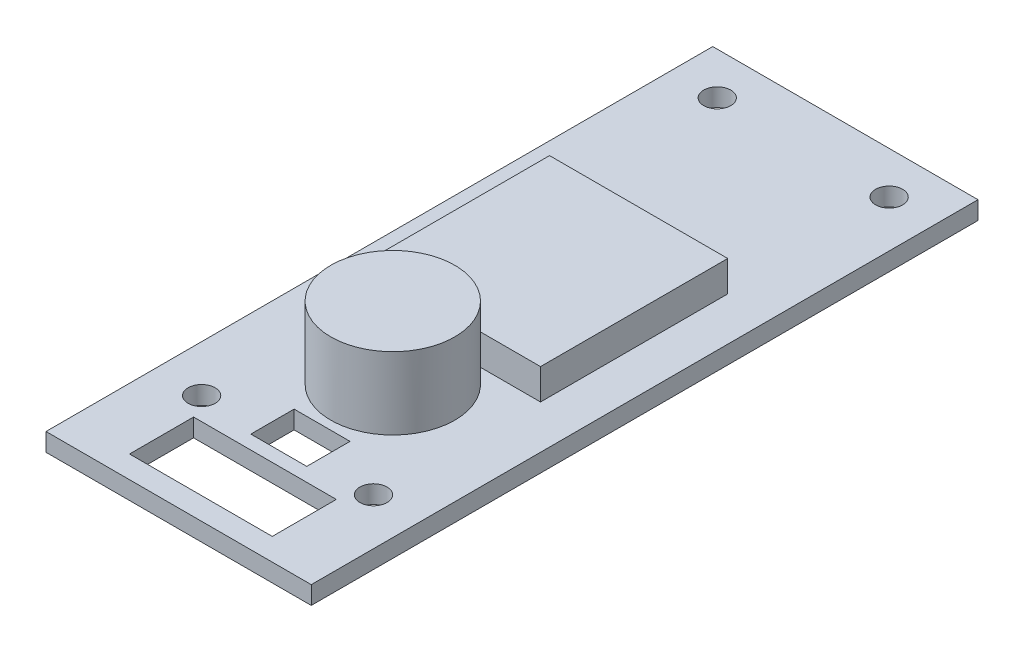
ISO-10303-21;
HEADER;
FILE_DESCRIPTION(('STEP AP214'),'2;1');
FILE_NAME('part.step','',(''),(''),'','','');
FILE_SCHEMA(('AUTOMOTIVE_DESIGN { 1 0 10303 214 1 1 1 1 }'));
ENDSEC;
DATA;
#1=APPLICATION_CONTEXT('core data for automotive mechanical design processes');
#2=APPLICATION_PROTOCOL_DEFINITION('international standard','automotive_design',2000,#1);
#3=PRODUCT_CONTEXT('',#1,'mechanical');
#4=PRODUCT('Part','Part','',(#3));
#5=PRODUCT_RELATED_PRODUCT_CATEGORY('part','',(#4));
#6=PRODUCT_DEFINITION_FORMATION('','',#4);
#7=PRODUCT_DEFINITION_CONTEXT('part definition',#1,'design');
#8=PRODUCT_DEFINITION('design','',#6,#7);
#9=PRODUCT_DEFINITION_SHAPE('','',#8);
#10=(LENGTH_UNIT() NAMED_UNIT(*) SI_UNIT(.MILLI.,.METRE.));
#11=(NAMED_UNIT(*) PLANE_ANGLE_UNIT() SI_UNIT($,.RADIAN.));
#12=(NAMED_UNIT(*) SI_UNIT($,.STERADIAN.) SOLID_ANGLE_UNIT());
#13=UNCERTAINTY_MEASURE_WITH_UNIT(LENGTH_MEASURE(1.E-05),#10,'distance_accuracy_value','');
#14=(GEOMETRIC_REPRESENTATION_CONTEXT(3) GLOBAL_UNCERTAINTY_ASSIGNED_CONTEXT((#13)) GLOBAL_UNIT_ASSIGNED_CONTEXT((#10,
#11,#12)) REPRESENTATION_CONTEXT('',''));
#15=CARTESIAN_POINT('',(0.,0.,0.));
#16=DIRECTION('',(0.,0.,1.));
#17=DIRECTION('',(1.,0.,0.));
#18=AXIS2_PLACEMENT_3D('',#15,#16,#17);
#19=CARTESIAN_POINT('',(0.,2.,36.95));
#20=DIRECTION('',(0.,0.,1.));
#21=DIRECTION('',(1.,0.,0.));
#22=AXIS2_PLACEMENT_3D('',#19,#20,#21);
#23=PLANE('',#22);
#24=DIRECTION('',(-1.,0.,0.));
#25=VECTOR('',#24,1.);
#26=CARTESIAN_POINT('',(0.,0.,36.95));
#27=LINE('',#26,#25);
#28=CARTESIAN_POINT('',(14.7,0.,36.95));
#29=VERTEX_POINT('',#28);
#30=CARTESIAN_POINT('',(-14.7,0.,36.95));
#31=VERTEX_POINT('',#30);
#32=EDGE_CURVE('E253',#29,#31,#27,.T.);
#33=ORIENTED_EDGE('',*,*,#32,.F.);
#34=DIRECTION('',(0.,-1.,0.));
#35=VECTOR('',#34,1.);
#36=CARTESIAN_POINT('',(14.7,2.,36.95));
#37=LINE('',#36,#35);
#38=CARTESIAN_POINT('',(14.7,2.,36.95));
#39=VERTEX_POINT('',#38);
#40=EDGE_CURVE('E12',#39,#29,#37,.T.);
#41=ORIENTED_EDGE('',*,*,#40,.F.);
#42=DIRECTION('',(-1.,0.,0.));
#43=VECTOR('',#42,1.);
#44=CARTESIAN_POINT('',(0.,2.,36.95));
#45=LINE('',#44,#43);
#46=CARTESIAN_POINT('',(-14.7,2.,36.95));
#47=VERTEX_POINT('',#46);
#48=EDGE_CURVE('E183',#39,#47,#45,.T.);
#49=ORIENTED_EDGE('',*,*,#48,.T.);
#50=DIRECTION('',(0.,-1.,0.));
#51=VECTOR('',#50,1.);
#52=CARTESIAN_POINT('',(-14.7,2.,36.95));
#53=LINE('',#52,#51);
#54=EDGE_CURVE('E70',#47,#31,#53,.T.);
#55=ORIENTED_EDGE('',*,*,#54,.T.);
#56=EDGE_LOOP('',(#33,#41,#49,#55));
#57=FACE_BOUND('',#56,.T.);
#58=ADVANCED_FACE('F44',(#57),#23,.T.);
#59=CARTESIAN_POINT('',(14.7,2.,0.));
#60=DIRECTION('',(-1.,0.,0.));
#61=DIRECTION('',(0.,0.,1.));
#62=AXIS2_PLACEMENT_3D('',#59,#60,#61);
#63=PLANE('',#62);
#64=DIRECTION('',(0.,0.,-1.));
#65=VECTOR('',#64,1.);
#66=CARTESIAN_POINT('',(14.7,0.,0.));
#67=LINE('',#66,#65);
#68=CARTESIAN_POINT('',(14.7,0.,-36.95));
#69=VERTEX_POINT('',#68);
#70=EDGE_CURVE('E188',#29,#69,#67,.T.);
#71=ORIENTED_EDGE('',*,*,#70,.T.);
#72=DIRECTION('',(0.,-1.,0.));
#73=VECTOR('',#72,1.);
#74=CARTESIAN_POINT('',(14.7,2.,-36.95));
#75=LINE('',#74,#73);
#76=CARTESIAN_POINT('',(14.7,2.,-36.95));
#77=VERTEX_POINT('',#76);
#78=EDGE_CURVE('E53',#77,#69,#75,.T.);
#79=ORIENTED_EDGE('',*,*,#78,.F.);
#80=DIRECTION('',(0.,0.,-1.));
#81=VECTOR('',#80,1.);
#82=CARTESIAN_POINT('',(14.7,2.,0.));
#83=LINE('',#82,#81);
#84=EDGE_CURVE('E178',#39,#77,#83,.T.);
#85=ORIENTED_EDGE('',*,*,#84,.F.);
#86=ORIENTED_EDGE('',*,*,#40,.T.);
#87=EDGE_LOOP('',(#71,#79,#85,#86));
#88=FACE_BOUND('',#87,.T.);
#89=ADVANCED_FACE('F186',(#88),#63,.F.);
#90=CARTESIAN_POINT('',(0.,2.,-36.95));
#91=DIRECTION('',(0.,0.,1.));
#92=DIRECTION('',(1.,0.,0.));
#93=AXIS2_PLACEMENT_3D('',#90,#91,#92);
#94=PLANE('',#93);
#95=DIRECTION('',(-1.,0.,0.));
#96=VECTOR('',#95,1.);
#97=CARTESIAN_POINT('',(0.,0.,-36.95));
#98=LINE('',#97,#96);
#99=CARTESIAN_POINT('',(-14.7,0.,-36.95));
#100=VERTEX_POINT('',#99);
#101=EDGE_CURVE('E256',#69,#100,#98,.T.);
#102=ORIENTED_EDGE('',*,*,#101,.T.);
#103=DIRECTION('',(0.,-1.,0.));
#104=VECTOR('',#103,1.);
#105=CARTESIAN_POINT('',(-14.7,2.,-36.95));
#106=LINE('',#105,#104);
#107=CARTESIAN_POINT('',(-14.7,2.,-36.95));
#108=VERTEX_POINT('',#107);
#109=EDGE_CURVE('E174',#108,#100,#106,.T.);
#110=ORIENTED_EDGE('',*,*,#109,.F.);
#111=DIRECTION('',(-1.,0.,0.));
#112=VECTOR('',#111,1.);
#113=CARTESIAN_POINT('',(0.,2.,-36.95));
#114=LINE('',#113,#112);
#115=EDGE_CURVE('E168',#77,#108,#114,.T.);
#116=ORIENTED_EDGE('',*,*,#115,.F.);
#117=ORIENTED_EDGE('',*,*,#78,.T.);
#118=EDGE_LOOP('',(#102,#110,#116,#117));
#119=FACE_BOUND('',#118,.T.);
#120=ADVANCED_FACE('F171',(#119),#94,.F.);
#121=CARTESIAN_POINT('',(-7.91000000000001,2.,0.));
#122=DIRECTION('',(1.,0.,0.));
#123=DIRECTION('',(0.,0.,-1.));
#124=AXIS2_PLACEMENT_3D('',#121,#122,#123);
#125=PLANE('',#124);
#126=DIRECTION('',(0.,0.,1.));
#127=VECTOR('',#126,1.);
#128=CARTESIAN_POINT('',(-7.91000000000001,0.,0.));
#129=LINE('',#128,#127);
#130=CARTESIAN_POINT('',(-7.91,0.,27.382));
#131=VERTEX_POINT('',#130);
#132=CARTESIAN_POINT('',(-7.91,0.,34.482));
#133=VERTEX_POINT('',#132);
#134=EDGE_CURVE('E241',#131,#133,#129,.T.);
#135=ORIENTED_EDGE('',*,*,#134,.F.);
#136=DIRECTION('',(0.,-1.,0.));
#137=VECTOR('',#136,1.);
#138=CARTESIAN_POINT('',(-7.91,2.,27.382));
#139=LINE('',#138,#137);
#140=CARTESIAN_POINT('',(-7.91,2.,27.382));
#141=VERTEX_POINT('',#140);
#142=EDGE_CURVE('E200',#141,#131,#139,.T.);
#143=ORIENTED_EDGE('',*,*,#142,.F.);
#144=DIRECTION('',(0.,0.,1.));
#145=VECTOR('',#144,1.);
#146=CARTESIAN_POINT('',(-7.91000000000001,2.,0.));
#147=LINE('',#146,#145);
#148=CARTESIAN_POINT('',(-7.91,2.,34.482));
#149=VERTEX_POINT('',#148);
#150=EDGE_CURVE('E286',#141,#149,#147,.T.);
#151=ORIENTED_EDGE('',*,*,#150,.T.);
#152=DIRECTION('',(0.,-1.,0.));
#153=VECTOR('',#152,1.);
#154=CARTESIAN_POINT('',(-7.91,2.,34.482));
#155=LINE('',#154,#153);
#156=EDGE_CURVE('E193',#149,#133,#155,.T.);
#157=ORIENTED_EDGE('',*,*,#156,.T.);
#158=EDGE_LOOP('',(#135,#143,#151,#157));
#159=FACE_BOUND('',#158,.T.);
#160=ADVANCED_FACE('F418',(#159),#125,.T.);
#161=CARTESIAN_POINT('',(0.,2.,27.382));
#162=DIRECTION('',(0.,0.,-1.));
#163=DIRECTION('',(-1.,0.,0.));
#164=AXIS2_PLACEMENT_3D('',#161,#162,#163);
#165=PLANE('',#164);
#166=DIRECTION('',(1.,0.,0.));
#167=VECTOR('',#166,1.);
#168=CARTESIAN_POINT('',(0.,0.,27.382));
#169=LINE('',#168,#167);
#170=CARTESIAN_POINT('',(7.91,0.,27.382));
#171=VERTEX_POINT('',#170);
#172=EDGE_CURVE('E244',#131,#171,#169,.T.);
#173=ORIENTED_EDGE('',*,*,#172,.T.);
#174=DIRECTION('',(0.,-1.,0.));
#175=VECTOR('',#174,1.);
#176=CARTESIAN_POINT('',(7.91,2.,27.382));
#177=LINE('',#176,#175);
#178=CARTESIAN_POINT('',(7.91,2.,27.382));
#179=VERTEX_POINT('',#178);
#180=EDGE_CURVE('E197',#179,#171,#177,.T.);
#181=ORIENTED_EDGE('',*,*,#180,.F.);
#182=DIRECTION('',(1.,0.,0.));
#183=VECTOR('',#182,1.);
#184=CARTESIAN_POINT('',(0.,2.,27.382));
#185=LINE('',#184,#183);
#186=EDGE_CURVE('E289',#141,#179,#185,.T.);
#187=ORIENTED_EDGE('',*,*,#186,.F.);
#188=ORIENTED_EDGE('',*,*,#142,.T.);
#189=EDGE_LOOP('',(#173,#181,#187,#188));
#190=FACE_BOUND('',#189,.T.);
#191=ADVANCED_FACE('F414',(#190),#165,.F.);
#192=CARTESIAN_POINT('',(7.90999999999999,2.,0.));
#193=DIRECTION('',(1.,0.,0.));
#194=DIRECTION('',(0.,0.,-1.));
#195=AXIS2_PLACEMENT_3D('',#192,#193,#194);
#196=PLANE('',#195);
#197=DIRECTION('',(0.,0.,1.));
#198=VECTOR('',#197,1.);
#199=CARTESIAN_POINT('',(7.90999999999999,0.,0.));
#200=LINE('',#199,#198);
#201=CARTESIAN_POINT('',(7.91,0.,34.482));
#202=VERTEX_POINT('',#201);
#203=EDGE_CURVE('E247',#171,#202,#200,.T.);
#204=ORIENTED_EDGE('',*,*,#203,.T.);
#205=DIRECTION('',(0.,-1.,0.));
#206=VECTOR('',#205,1.);
#207=CARTESIAN_POINT('',(7.91,2.,34.482));
#208=LINE('',#207,#206);
#209=CARTESIAN_POINT('',(7.91,2.,34.482));
#210=VERTEX_POINT('',#209);
#211=EDGE_CURVE('E195',#210,#202,#208,.T.);
#212=ORIENTED_EDGE('',*,*,#211,.F.);
#213=DIRECTION('',(0.,0.,1.));
#214=VECTOR('',#213,1.);
#215=CARTESIAN_POINT('',(7.90999999999999,2.,0.));
#216=LINE('',#215,#214);
#217=EDGE_CURVE('E292',#179,#210,#216,.T.);
#218=ORIENTED_EDGE('',*,*,#217,.F.);
#219=ORIENTED_EDGE('',*,*,#180,.T.);
#220=EDGE_LOOP('',(#204,#212,#218,#219));
#221=FACE_BOUND('',#220,.T.);
#222=ADVANCED_FACE('F411',(#221),#196,.F.);
#223=CARTESIAN_POINT('',(3.1,2.,0.));
#224=DIRECTION('',(-1.,0.,0.));
#225=DIRECTION('',(0.,0.,1.));
#226=AXIS2_PLACEMENT_3D('',#223,#224,#225);
#227=PLANE('',#226);
#228=DIRECTION('',(0.,0.,-1.));
#229=VECTOR('',#228,1.);
#230=CARTESIAN_POINT('',(3.1,0.,0.));
#231=LINE('',#230,#229);
#232=CARTESIAN_POINT('',(3.1,0.,25.849));
#233=VERTEX_POINT('',#232);
#234=CARTESIAN_POINT('',(3.1,0.,21.049));
#235=VERTEX_POINT('',#234);
#236=EDGE_CURVE('E227',#233,#235,#231,.T.);
#237=ORIENTED_EDGE('',*,*,#236,.F.);
#238=DIRECTION('',(0.,-1.,0.));
#239=VECTOR('',#238,1.);
#240=CARTESIAN_POINT('',(3.1,2.,25.849));
#241=LINE('',#240,#239);
#242=CARTESIAN_POINT('',(3.1,2.,25.849));
#243=VERTEX_POINT('',#242);
#244=EDGE_CURVE('E48',#243,#233,#241,.T.);
#245=ORIENTED_EDGE('',*,*,#244,.F.);
#246=DIRECTION('',(0.,0.,-1.));
#247=VECTOR('',#246,1.);
#248=CARTESIAN_POINT('',(3.1,2.,0.));
#249=LINE('',#248,#247);
#250=CARTESIAN_POINT('',(3.1,2.,21.049));
#251=VERTEX_POINT('',#250);
#252=EDGE_CURVE('E278',#243,#251,#249,.T.);
#253=ORIENTED_EDGE('',*,*,#252,.T.);
#254=DIRECTION('',(0.,-1.,0.));
#255=VECTOR('',#254,1.);
#256=CARTESIAN_POINT('',(3.1,2.,21.049));
#257=LINE('',#256,#255);
#258=EDGE_CURVE('E202',#251,#235,#257,.T.);
#259=ORIENTED_EDGE('',*,*,#258,.T.);
#260=EDGE_LOOP('',(#237,#245,#253,#259));
#261=FACE_BOUND('',#260,.T.);
#262=ADVANCED_FACE('F46',(#261),#227,.T.);
#263=CARTESIAN_POINT('',(0.,2.,25.849));
#264=DIRECTION('',(0.,0.,1.));
#265=DIRECTION('',(1.,0.,0.));
#266=AXIS2_PLACEMENT_3D('',#263,#264,#265);
#267=PLANE('',#266);
#268=DIRECTION('',(-1.,0.,0.));
#269=VECTOR('',#268,1.);
#270=CARTESIAN_POINT('',(0.,0.,25.849));
#271=LINE('',#270,#269);
#272=CARTESIAN_POINT('',(-3.1,0.,25.849));
#273=VERTEX_POINT('',#272);
#274=EDGE_CURVE('E215',#233,#273,#271,.T.);
#275=ORIENTED_EDGE('',*,*,#274,.T.);
#276=DIRECTION('',(0.,-1.,0.));
#277=VECTOR('',#276,1.);
#278=CARTESIAN_POINT('',(-3.1,2.,25.849));
#279=LINE('',#278,#277);
#280=CARTESIAN_POINT('',(-3.1,2.,25.849));
#281=VERTEX_POINT('',#280);
#282=EDGE_CURVE('E205',#281,#273,#279,.T.);
#283=ORIENTED_EDGE('',*,*,#282,.F.);
#284=DIRECTION('',(-1.,0.,0.));
#285=VECTOR('',#284,1.);
#286=CARTESIAN_POINT('',(0.,2.,25.849));
#287=LINE('',#286,#285);
#288=EDGE_CURVE('E217',#243,#281,#287,.T.);
#289=ORIENTED_EDGE('',*,*,#288,.F.);
#290=ORIENTED_EDGE('',*,*,#244,.T.);
#291=EDGE_LOOP('',(#275,#283,#289,#290));
#292=FACE_BOUND('',#291,.T.);
#293=ADVANCED_FACE('F214',(#292),#267,.F.);
#294=CARTESIAN_POINT('',(-3.1,2.,0.));
#295=DIRECTION('',(-1.,0.,0.));
#296=DIRECTION('',(0.,0.,1.));
#297=AXIS2_PLACEMENT_3D('',#294,#295,#296);
#298=PLANE('',#297);
#299=DIRECTION('',(0.,0.,-1.));
#300=VECTOR('',#299,1.);
#301=CARTESIAN_POINT('',(-3.1,0.,0.));
#302=LINE('',#301,#300);
#303=CARTESIAN_POINT('',(-3.1,0.,21.049));
#304=VERTEX_POINT('',#303);
#305=EDGE_CURVE('E229',#273,#304,#302,.T.);
#306=ORIENTED_EDGE('',*,*,#305,.T.);
#307=DIRECTION('',(0.,-1.,0.));
#308=VECTOR('',#307,1.);
#309=CARTESIAN_POINT('',(-3.1,2.,21.049));
#310=LINE('',#309,#308);
#311=CARTESIAN_POINT('',(-3.1,2.,21.049));
#312=VERTEX_POINT('',#311);
#313=EDGE_CURVE('E204',#312,#304,#310,.T.);
#314=ORIENTED_EDGE('',*,*,#313,.F.);
#315=DIRECTION('',(0.,0.,-1.));
#316=VECTOR('',#315,1.);
#317=CARTESIAN_POINT('',(-3.1,2.,0.));
#318=LINE('',#317,#316);
#319=EDGE_CURVE('E281',#281,#312,#318,.T.);
#320=ORIENTED_EDGE('',*,*,#319,.F.);
#321=ORIENTED_EDGE('',*,*,#282,.T.);
#322=EDGE_LOOP('',(#306,#314,#320,#321));
#323=FACE_BOUND('',#322,.T.);
#324=ADVANCED_FACE('F409',(#323),#298,.F.);
#325=CARTESIAN_POINT('',(0.,2.,34.482));
#326=DIRECTION('',(0.,0.,-1.));
#327=DIRECTION('',(-1.,0.,0.));
#328=AXIS2_PLACEMENT_3D('',#325,#326,#327);
#329=PLANE('',#328);
#330=DIRECTION('',(1.,0.,0.));
#331=VECTOR('',#330,1.);
#332=CARTESIAN_POINT('',(0.,0.,34.482));
#333=LINE('',#332,#331);
#334=EDGE_CURVE('E250',#133,#202,#333,.T.);
#335=ORIENTED_EDGE('',*,*,#334,.F.);
#336=ORIENTED_EDGE('',*,*,#156,.F.);
#337=DIRECTION('',(1.,0.,0.));
#338=VECTOR('',#337,1.);
#339=CARTESIAN_POINT('',(0.,2.,34.482));
#340=LINE('',#339,#338);
#341=EDGE_CURVE('E294',#149,#210,#340,.T.);
#342=ORIENTED_EDGE('',*,*,#341,.T.);
#343=ORIENTED_EDGE('',*,*,#211,.T.);
#344=EDGE_LOOP('',(#335,#336,#342,#343));
#345=FACE_BOUND('',#344,.T.);
#346=ADVANCED_FACE('F405',(#345),#329,.T.);
#347=CARTESIAN_POINT('',(0.,2.,21.049));
#348=DIRECTION('',(0.,0.,1.));
#349=DIRECTION('',(1.,0.,0.));
#350=AXIS2_PLACEMENT_3D('',#347,#348,#349);
#351=PLANE('',#350);
#352=DIRECTION('',(-1.,0.,0.));
#353=VECTOR('',#352,1.);
#354=CARTESIAN_POINT('',(0.,0.,21.049));
#355=LINE('',#354,#353);
#356=EDGE_CURVE('E239',#235,#304,#355,.T.);
#357=ORIENTED_EDGE('',*,*,#356,.F.);
#358=ORIENTED_EDGE('',*,*,#258,.F.);
#359=DIRECTION('',(-1.,0.,0.));
#360=VECTOR('',#359,1.);
#361=CARTESIAN_POINT('',(0.,2.,21.049));
#362=LINE('',#361,#360);
#363=EDGE_CURVE('E283',#251,#312,#362,.T.);
#364=ORIENTED_EDGE('',*,*,#363,.T.);
#365=ORIENTED_EDGE('',*,*,#313,.T.);
#366=EDGE_LOOP('',(#357,#358,#364,#365));
#367=FACE_BOUND('',#366,.T.);
#368=ADVANCED_FACE('F408',(#367),#351,.T.);
#369=CARTESIAN_POINT('',(-14.7,2.,0.));
#370=DIRECTION('',(-1.,0.,0.));
#371=DIRECTION('',(0.,0.,1.));
#372=AXIS2_PLACEMENT_3D('',#369,#370,#371);
#373=PLANE('',#372);
#374=DIRECTION('',(0.,0.,-1.));
#375=VECTOR('',#374,1.);
#376=CARTESIAN_POINT('',(-14.7,0.,0.));
#377=LINE('',#376,#375);
#378=EDGE_CURVE('E258',#31,#100,#377,.T.);
#379=ORIENTED_EDGE('',*,*,#378,.F.);
#380=ORIENTED_EDGE('',*,*,#54,.F.);
#381=DIRECTION('',(0.,0.,-1.));
#382=VECTOR('',#381,1.);
#383=CARTESIAN_POINT('',(-14.7,2.,0.));
#384=LINE('',#383,#382);
#385=EDGE_CURVE('E177',#47,#108,#384,.T.);
#386=ORIENTED_EDGE('',*,*,#385,.T.);
#387=ORIENTED_EDGE('',*,*,#109,.T.);
#388=EDGE_LOOP('',(#379,#380,#386,#387));
#389=FACE_BOUND('',#388,.T.);
#390=ADVANCED_FACE('F297',(#389),#373,.T.);
#391=CARTESIAN_POINT('',(0.,2.,0.));
#392=DIRECTION('',(0.,1.,0.));
#393=DIRECTION('',(0.,0.,1.));
#394=AXIS2_PLACEMENT_3D('',#391,#392,#393);
#395=PLANE('',#394);
#396=CARTESIAN_POINT('',(-9.525,2.,24.875));
#397=DIRECTION('',(0.,1.,0.));
#398=DIRECTION('',(0.,0.,1.));
#399=AXIS2_PLACEMENT_3D('',#396,#397,#398);
#400=CIRCLE('',#399,1.5);
#401=CARTESIAN_POINT('',(-9.525,2.,26.375));
#402=VERTEX_POINT('',#401);
#403=EDGE_CURVE('E830',#402,#402,#400,.T.);
#404=ORIENTED_EDGE('',*,*,#403,.F.);
#405=EDGE_LOOP('',(#404));
#406=FACE_BOUND('',#405,.T.);
#407=CARTESIAN_POINT('',(9.52500000000001,2.,24.875));
#408=DIRECTION('',(0.,1.,0.));
#409=DIRECTION('',(0.,0.,1.));
#410=AXIS2_PLACEMENT_3D('',#407,#408,#409);
#411=CIRCLE('',#410,1.5);
#412=CARTESIAN_POINT('',(9.52500000000001,2.,26.375));
#413=VERTEX_POINT('',#412);
#414=EDGE_CURVE('E850',#413,#413,#411,.T.);
#415=ORIENTED_EDGE('',*,*,#414,.F.);
#416=EDGE_LOOP('',(#415));
#417=FACE_BOUND('',#416,.T.);
#418=CARTESIAN_POINT('',(9.525,2.,-32.275));
#419=DIRECTION('',(0.,1.,0.));
#420=DIRECTION('',(0.,0.,1.));
#421=AXIS2_PLACEMENT_3D('',#418,#419,#420);
#422=CIRCLE('',#421,1.5);
#423=CARTESIAN_POINT('',(9.525,2.,-30.775));
#424=VERTEX_POINT('',#423);
#425=EDGE_CURVE('E847',#424,#424,#422,.T.);
#426=ORIENTED_EDGE('',*,*,#425,.F.);
#427=EDGE_LOOP('',(#426));
#428=FACE_BOUND('',#427,.T.);
#429=CARTESIAN_POINT('',(-9.525,2.,-32.275));
#430=DIRECTION('',(0.,1.,0.));
#431=DIRECTION('',(0.,0.,1.));
#432=AXIS2_PLACEMENT_3D('',#429,#430,#431);
#433=CIRCLE('',#432,1.5);
#434=CARTESIAN_POINT('',(-9.525,2.,-30.775));
#435=VERTEX_POINT('',#434);
#436=EDGE_CURVE('E844',#435,#435,#433,.T.);
#437=ORIENTED_EDGE('',*,*,#436,.F.);
#438=EDGE_LOOP('',(#437));
#439=FACE_BOUND('',#438,.T.);
#440=CARTESIAN_POINT('',(0.,2.,13.214));
#441=DIRECTION('',(0.,1.,0.));
#442=DIRECTION('',(0.,0.,1.));
#443=AXIS2_PLACEMENT_3D('',#440,#441,#442);
#444=CIRCLE('',#443,6.875);
#445=CARTESIAN_POINT('',(-2.2395591083961,2.,6.71400000000001));
#446=VERTEX_POINT('',#445);
#447=CARTESIAN_POINT('',(2.23955910839613,2.,6.71400000000001));
#448=VERTEX_POINT('',#447);
#449=EDGE_CURVE('E121',#446,#448,#444,.T.);
#450=ORIENTED_EDGE('',*,*,#449,.F.);
#451=DIRECTION('',(-1.,0.,0.));
#452=VECTOR('',#451,1.);
#453=CARTESIAN_POINT('',(0.,2.,6.71400000000001));
#454=LINE('',#453,#452);
#455=CARTESIAN_POINT('',(-9.87499999999999,2.,6.71400000000002));
#456=VERTEX_POINT('',#455);
#457=EDGE_CURVE('E261',#446,#456,#454,.T.);
#458=ORIENTED_EDGE('',*,*,#457,.T.);
#459=DIRECTION('',(0.,0.,1.));
#460=VECTOR('',#459,1.);
#461=CARTESIAN_POINT('',(-9.87499999999999,2.,0.));
#462=LINE('',#461,#460);
#463=CARTESIAN_POINT('',(-9.87499999999999,2.,-14.036));
#464=VERTEX_POINT('',#463);
#465=EDGE_CURVE('E266',#464,#456,#462,.T.);
#466=ORIENTED_EDGE('',*,*,#465,.F.);
#467=DIRECTION('',(-1.,0.,0.));
#468=VECTOR('',#467,1.);
#469=CARTESIAN_POINT('',(0.,2.,-14.036));
#470=LINE('',#469,#468);
#471=CARTESIAN_POINT('',(9.87500000000001,2.,-14.036));
#472=VERTEX_POINT('',#471);
#473=EDGE_CURVE('E273',#472,#464,#470,.T.);
#474=ORIENTED_EDGE('',*,*,#473,.F.);
#475=DIRECTION('',(0.,0.,1.));
#476=VECTOR('',#475,1.);
#477=CARTESIAN_POINT('',(9.87500000000002,2.,0.));
#478=LINE('',#477,#476);
#479=CARTESIAN_POINT('',(9.87500000000002,2.,6.71400000000001));
#480=VERTEX_POINT('',#479);
#481=EDGE_CURVE('E276',#472,#480,#478,.T.);
#482=ORIENTED_EDGE('',*,*,#481,.T.);
#483=EDGE_CURVE('E268',#480,#448,#454,.T.);
#484=ORIENTED_EDGE('',*,*,#483,.T.);
#485=EDGE_LOOP('',(#450,#458,#466,#474,#482,#484));
#486=FACE_BOUND('',#485,.T.);
#487=ORIENTED_EDGE('',*,*,#252,.F.);
#488=ORIENTED_EDGE('',*,*,#288,.T.);
#489=ORIENTED_EDGE('',*,*,#319,.T.);
#490=ORIENTED_EDGE('',*,*,#363,.F.);
#491=EDGE_LOOP('',(#487,#488,#489,#490));
#492=FACE_BOUND('',#491,.T.);
#493=ORIENTED_EDGE('',*,*,#150,.F.);
#494=ORIENTED_EDGE('',*,*,#186,.T.);
#495=ORIENTED_EDGE('',*,*,#217,.T.);
#496=ORIENTED_EDGE('',*,*,#341,.F.);
#497=EDGE_LOOP('',(#493,#494,#495,#496));
#498=FACE_BOUND('',#497,.T.);
#499=ORIENTED_EDGE('',*,*,#48,.F.);
#500=ORIENTED_EDGE('',*,*,#84,.T.);
#501=ORIENTED_EDGE('',*,*,#115,.T.);
#502=ORIENTED_EDGE('',*,*,#385,.F.);
#503=EDGE_LOOP('',(#499,#500,#501,#502));
#504=FACE_BOUND('',#503,.T.);
#505=ADVANCED_FACE('F182',(#406,#417,#428,#439,#486,#492,#498,#504),#395,.T.);
#506=CARTESIAN_POINT('',(0.,0.,0.));
#507=DIRECTION('',(0.,1.,0.));
#508=DIRECTION('',(0.,0.,1.));
#509=AXIS2_PLACEMENT_3D('',#506,#507,#508);
#510=PLANE('',#509);
#511=CARTESIAN_POINT('',(-9.525,0.,24.875));
#512=DIRECTION('',(0.,1.,0.));
#513=DIRECTION('',(0.,0.,1.));
#514=AXIS2_PLACEMENT_3D('',#511,#512,#513);
#515=CIRCLE('',#514,1.5);
#516=CARTESIAN_POINT('',(-9.525,0.,26.375));
#517=VERTEX_POINT('',#516);
#518=EDGE_CURVE('E833',#517,#517,#515,.T.);
#519=ORIENTED_EDGE('',*,*,#518,.T.);
#520=EDGE_LOOP('',(#519));
#521=FACE_BOUND('',#520,.T.);
#522=CARTESIAN_POINT('',(9.52500000000001,0.,24.875));
#523=DIRECTION('',(0.,1.,0.));
#524=DIRECTION('',(0.,0.,1.));
#525=AXIS2_PLACEMENT_3D('',#522,#523,#524);
#526=CIRCLE('',#525,1.5);
#527=CARTESIAN_POINT('',(9.52500000000001,0.,26.375));
#528=VERTEX_POINT('',#527);
#529=EDGE_CURVE('E834',#528,#528,#526,.T.);
#530=ORIENTED_EDGE('',*,*,#529,.T.);
#531=EDGE_LOOP('',(#530));
#532=FACE_BOUND('',#531,.T.);
#533=CARTESIAN_POINT('',(9.525,0.,-32.275));
#534=DIRECTION('',(0.,1.,0.));
#535=DIRECTION('',(0.,0.,1.));
#536=AXIS2_PLACEMENT_3D('',#533,#534,#535);
#537=CIRCLE('',#536,1.5);
#538=CARTESIAN_POINT('',(9.525,0.,-30.775));
#539=VERTEX_POINT('',#538);
#540=EDGE_CURVE('E837',#539,#539,#537,.T.);
#541=ORIENTED_EDGE('',*,*,#540,.T.);
#542=EDGE_LOOP('',(#541));
#543=FACE_BOUND('',#542,.T.);
#544=CARTESIAN_POINT('',(-9.525,0.,-32.275));
#545=DIRECTION('',(0.,1.,0.));
#546=DIRECTION('',(0.,0.,1.));
#547=AXIS2_PLACEMENT_3D('',#544,#545,#546);
#548=CIRCLE('',#547,1.5);
#549=CARTESIAN_POINT('',(-9.525,0.,-30.775));
#550=VERTEX_POINT('',#549);
#551=EDGE_CURVE('E841',#550,#550,#548,.T.);
#552=ORIENTED_EDGE('',*,*,#551,.T.);
#553=EDGE_LOOP('',(#552));
#554=FACE_BOUND('',#553,.T.);
#555=DIRECTION('',(0.,0.,1.));
#556=VECTOR('',#555,1.);
#557=CARTESIAN_POINT('',(9.50000000000001,0.,-13.161));
#558=LINE('',#557,#556);
#559=CARTESIAN_POINT('',(9.50000000000001,0.,-13.161));
#560=VERTEX_POINT('',#559);
#561=CARTESIAN_POINT('',(9.50000000000001,0.,5.83900000000001));
#562=VERTEX_POINT('',#561);
#563=EDGE_CURVE('E857',#560,#562,#558,.T.);
#564=ORIENTED_EDGE('',*,*,#563,.F.);
#565=DIRECTION('',(1.,0.,0.));
#566=VECTOR('',#565,1.);
#567=CARTESIAN_POINT('',(9.50000000000001,0.,-13.161));
#568=LINE('',#567,#566);
#569=CARTESIAN_POINT('',(-9.49999999999999,0.,-13.161));
#570=VERTEX_POINT('',#569);
#571=EDGE_CURVE('E860',#570,#560,#568,.T.);
#572=ORIENTED_EDGE('',*,*,#571,.F.);
#573=DIRECTION('',(0.,0.,-1.));
#574=VECTOR('',#573,1.);
#575=CARTESIAN_POINT('',(-9.49999999999999,0.,-13.161));
#576=LINE('',#575,#574);
#577=CARTESIAN_POINT('',(-9.49999999999999,0.,5.83900000000001));
#578=VERTEX_POINT('',#577);
#579=EDGE_CURVE('E854',#578,#570,#576,.T.);
#580=ORIENTED_EDGE('',*,*,#579,.F.);
#581=DIRECTION('',(-1.,0.,0.));
#582=VECTOR('',#581,1.);
#583=CARTESIAN_POINT('',(9.50000000000001,0.,5.83900000000001));
#584=LINE('',#583,#582);
#585=EDGE_CURVE('E61',#562,#578,#584,.T.);
#586=ORIENTED_EDGE('',*,*,#585,.F.);
#587=EDGE_LOOP('',(#564,#572,#580,#586));
#588=FACE_BOUND('',#587,.T.);
#589=ORIENTED_EDGE('',*,*,#236,.T.);
#590=ORIENTED_EDGE('',*,*,#356,.T.);
#591=ORIENTED_EDGE('',*,*,#305,.F.);
#592=ORIENTED_EDGE('',*,*,#274,.F.);
#593=EDGE_LOOP('',(#589,#590,#591,#592));
#594=FACE_BOUND('',#593,.T.);
#595=ORIENTED_EDGE('',*,*,#134,.T.);
#596=ORIENTED_EDGE('',*,*,#334,.T.);
#597=ORIENTED_EDGE('',*,*,#203,.F.);
#598=ORIENTED_EDGE('',*,*,#172,.F.);
#599=EDGE_LOOP('',(#595,#596,#597,#598));
#600=FACE_BOUND('',#599,.T.);
#601=ORIENTED_EDGE('',*,*,#32,.T.);
#602=ORIENTED_EDGE('',*,*,#378,.T.);
#603=ORIENTED_EDGE('',*,*,#101,.F.);
#604=ORIENTED_EDGE('',*,*,#70,.F.);
#605=EDGE_LOOP('',(#601,#602,#603,#604));
#606=FACE_BOUND('',#605,.T.);
#607=CARTESIAN_POINT('',(0.,0.,13.214));
#608=DIRECTION('',(0.,1.,0.));
#609=DIRECTION('',(0.,0.,1.));
#610=AXIS2_PLACEMENT_3D('',#607,#608,#609);
#611=CIRCLE('',#610,6.125);
#612=CARTESIAN_POINT('',(0.,0.,19.339));
#613=VERTEX_POINT('',#612);
#614=EDGE_CURVE('E305',#613,#613,#611,.T.);
#615=ORIENTED_EDGE('',*,*,#614,.T.);
#616=EDGE_LOOP('',(#615));
#617=FACE_BOUND('',#616,.T.);
#618=ADVANCED_FACE('F224',(#521,#532,#543,#554,#588,#594,#600,#606,#617),#510,.F.);
#619=CARTESIAN_POINT('',(0.,5.4,6.71400000000001));
#620=DIRECTION('',(0.,0.,1.));
#621=DIRECTION('',(1.,0.,0.));
#622=AXIS2_PLACEMENT_3D('',#619,#620,#621);
#623=PLANE('',#622);
#624=DIRECTION('',(0.,-1.,0.));
#625=VECTOR('',#624,1.);
#626=CARTESIAN_POINT('',(2.23955910839613,5.4,6.71400000000001));
#627=LINE('',#626,#625);
#628=CARTESIAN_POINT('',(2.23955910839613,5.4,6.71400000000001));
#629=VERTEX_POINT('',#628);
#630=EDGE_CURVE('E231',#629,#448,#627,.T.);
#631=ORIENTED_EDGE('',*,*,#630,.T.);
#632=ORIENTED_EDGE('',*,*,#483,.F.);
#633=DIRECTION('',(0.,-1.,0.));
#634=VECTOR('',#633,1.);
#635=CARTESIAN_POINT('',(9.87500000000002,5.4,6.71400000000001));
#636=LINE('',#635,#634);
#637=CARTESIAN_POINT('',(9.87500000000002,5.4,6.71400000000001));
#638=VERTEX_POINT('',#637);
#639=EDGE_CURVE('E234',#638,#480,#636,.T.);
#640=ORIENTED_EDGE('',*,*,#639,.F.);
#641=DIRECTION('',(-1.,0.,0.));
#642=VECTOR('',#641,1.);
#643=CARTESIAN_POINT('',(0.,5.4,6.71400000000001));
#644=LINE('',#643,#642);
#645=EDGE_CURVE('E322',#638,#629,#644,.T.);
#646=ORIENTED_EDGE('',*,*,#645,.T.);
#647=EDGE_LOOP('',(#631,#632,#640,#646));
#648=FACE_BOUND('',#647,.T.);
#649=ADVANCED_FACE('F300',(#648),#623,.T.);
#650=CARTESIAN_POINT('',(9.87500000000002,5.4,0.));
#651=DIRECTION('',(1.,0.,0.));
#652=DIRECTION('',(0.,0.,-1.));
#653=AXIS2_PLACEMENT_3D('',#650,#651,#652);
#654=PLANE('',#653);
#655=ORIENTED_EDGE('',*,*,#639,.T.);
#656=ORIENTED_EDGE('',*,*,#481,.F.);
#657=DIRECTION('',(0.,-1.,0.));
#658=VECTOR('',#657,1.);
#659=CARTESIAN_POINT('',(9.87500000000001,5.4,-14.036));
#660=LINE('',#659,#658);
#661=CARTESIAN_POINT('',(9.87500000000001,5.4,-14.036));
#662=VERTEX_POINT('',#661);
#663=EDGE_CURVE('E343',#662,#472,#660,.T.);
#664=ORIENTED_EDGE('',*,*,#663,.F.);
#665=DIRECTION('',(0.,0.,1.));
#666=VECTOR('',#665,1.);
#667=CARTESIAN_POINT('',(9.87500000000002,5.4,0.));
#668=LINE('',#667,#666);
#669=EDGE_CURVE('E325',#662,#638,#668,.T.);
#670=ORIENTED_EDGE('',*,*,#669,.T.);
#671=EDGE_LOOP('',(#655,#656,#664,#670));
#672=FACE_BOUND('',#671,.T.);
#673=ADVANCED_FACE('F349',(#672),#654,.T.);
#674=CARTESIAN_POINT('',(0.,5.4,-14.036));
#675=DIRECTION('',(0.,0.,1.));
#676=DIRECTION('',(1.,0.,0.));
#677=AXIS2_PLACEMENT_3D('',#674,#675,#676);
#678=PLANE('',#677);
#679=ORIENTED_EDGE('',*,*,#473,.T.);
#680=DIRECTION('',(0.,-1.,0.));
#681=VECTOR('',#680,1.);
#682=CARTESIAN_POINT('',(-9.87499999999999,5.4,-14.036));
#683=LINE('',#682,#681);
#684=CARTESIAN_POINT('',(-9.87499999999999,5.4,-14.036));
#685=VERTEX_POINT('',#684);
#686=EDGE_CURVE('E340',#685,#464,#683,.T.);
#687=ORIENTED_EDGE('',*,*,#686,.F.);
#688=DIRECTION('',(-1.,0.,0.));
#689=VECTOR('',#688,1.);
#690=CARTESIAN_POINT('',(0.,5.4,-14.036));
#691=LINE('',#690,#689);
#692=EDGE_CURVE('E329',#662,#685,#691,.T.);
#693=ORIENTED_EDGE('',*,*,#692,.F.);
#694=ORIENTED_EDGE('',*,*,#663,.T.);
#695=EDGE_LOOP('',(#679,#687,#693,#694));
#696=FACE_BOUND('',#695,.T.);
#697=ADVANCED_FACE('F388',(#696),#678,.F.);
#698=CARTESIAN_POINT('',(-9.87499999999999,5.4,0.));
#699=DIRECTION('',(1.,0.,0.));
#700=DIRECTION('',(0.,0.,-1.));
#701=AXIS2_PLACEMENT_3D('',#698,#699,#700);
#702=PLANE('',#701);
#703=ORIENTED_EDGE('',*,*,#465,.T.);
#704=DIRECTION('',(0.,-1.,0.));
#705=VECTOR('',#704,1.);
#706=CARTESIAN_POINT('',(-9.87499999999999,5.4,6.71400000000002));
#707=LINE('',#706,#705);
#708=CARTESIAN_POINT('',(-9.87499999999999,5.4,6.71400000000002));
#709=VERTEX_POINT('',#708);
#710=EDGE_CURVE('E337',#709,#456,#707,.T.);
#711=ORIENTED_EDGE('',*,*,#710,.F.);
#712=DIRECTION('',(0.,0.,1.));
#713=VECTOR('',#712,1.);
#714=CARTESIAN_POINT('',(-9.87499999999999,5.4,0.));
#715=LINE('',#714,#713);
#716=EDGE_CURVE('E332',#685,#709,#715,.T.);
#717=ORIENTED_EDGE('',*,*,#716,.F.);
#718=ORIENTED_EDGE('',*,*,#686,.T.);
#719=EDGE_LOOP('',(#703,#711,#717,#718));
#720=FACE_BOUND('',#719,.T.);
#721=ADVANCED_FACE('F383',(#720),#702,.F.);
#722=ORIENTED_EDGE('',*,*,#710,.T.);
#723=ORIENTED_EDGE('',*,*,#457,.F.);
#724=DIRECTION('',(0.,-1.,0.));
#725=VECTOR('',#724,1.);
#726=CARTESIAN_POINT('',(-2.2395591083961,5.4,6.71400000000001));
#727=LINE('',#726,#725);
#728=CARTESIAN_POINT('',(-2.2395591083961,5.4,6.71400000000001));
#729=VERTEX_POINT('',#728);
#730=EDGE_CURVE('E335',#729,#446,#727,.T.);
#731=ORIENTED_EDGE('',*,*,#730,.F.);
#732=EDGE_CURVE('E326',#729,#709,#644,.T.);
#733=ORIENTED_EDGE('',*,*,#732,.T.);
#734=EDGE_LOOP('',(#722,#723,#731,#733));
#735=FACE_BOUND('',#734,.T.);
#736=ADVANCED_FACE('F385',(#735),#623,.T.);
#737=CARTESIAN_POINT('',(0.,5.4,0.));
#738=DIRECTION('',(0.,1.,0.));
#739=DIRECTION('',(0.,0.,1.));
#740=AXIS2_PLACEMENT_3D('',#737,#738,#739);
#741=PLANE('',#740);
#742=CARTESIAN_POINT('',(0.,5.4,13.214));
#743=DIRECTION('',(0.,1.,0.));
#744=DIRECTION('',(0.,0.,1.));
#745=AXIS2_PLACEMENT_3D('',#742,#743,#744);
#746=CIRCLE('',#745,6.875);
#747=EDGE_CURVE('E319',#629,#729,#746,.T.);
#748=ORIENTED_EDGE('',*,*,#747,.F.);
#749=ORIENTED_EDGE('',*,*,#645,.F.);
#750=ORIENTED_EDGE('',*,*,#669,.F.);
#751=ORIENTED_EDGE('',*,*,#692,.T.);
#752=ORIENTED_EDGE('',*,*,#716,.T.);
#753=ORIENTED_EDGE('',*,*,#732,.F.);
#754=EDGE_LOOP('',(#748,#749,#750,#751,#752,#753));
#755=FACE_BOUND('',#754,.T.);
#756=ADVANCED_FACE('F361',(#755),#741,.T.);
#757=CARTESIAN_POINT('',(0.,10.,13.214));
#758=DIRECTION('',(0.,1.,0.));
#759=DIRECTION('',(0.,0.,1.));
#760=AXIS2_PLACEMENT_3D('',#757,#758,#759);
#761=PLANE('',#760);
#762=CARTESIAN_POINT('',(0.,10.,13.214));
#763=DIRECTION('',(0.,1.,0.));
#764=DIRECTION('',(0.,0.,1.));
#765=AXIS2_PLACEMENT_3D('',#762,#763,#764);
#766=CIRCLE('',#765,6.875);
#767=CARTESIAN_POINT('',(0.,10.,20.089));
#768=VERTEX_POINT('',#767);
#769=EDGE_CURVE('E311',#768,#768,#766,.T.);
#770=ORIENTED_EDGE('',*,*,#769,.T.);
#771=EDGE_LOOP('',(#770));
#772=FACE_BOUND('',#771,.T.);
#773=ADVANCED_FACE('F578',(#772),#761,.T.);
#774=CARTESIAN_POINT('',(0.,10.,13.214));
#775=DIRECTION('',(0.,-1.,0.));
#776=DIRECTION('',(0.,0.,-1.));
#777=AXIS2_PLACEMENT_3D('',#774,#775,#776);
#778=CYLINDRICAL_SURFACE('',#777,6.875);
#779=ORIENTED_EDGE('',*,*,#449,.T.);
#780=ORIENTED_EDGE('',*,*,#630,.F.);
#781=ORIENTED_EDGE('',*,*,#747,.T.);
#782=ORIENTED_EDGE('',*,*,#730,.T.);
#783=EDGE_LOOP('',(#779,#780,#781,#782));
#784=FACE_BOUND('',#783,.T.);
#785=ORIENTED_EDGE('',*,*,#769,.F.);
#786=EDGE_LOOP('',(#785));
#787=FACE_BOUND('',#786,.T.);
#788=ADVANCED_FACE('F367',(#784,#787),#778,.T.);
#789=CARTESIAN_POINT('',(0.,10.,13.214));
#790=DIRECTION('',(0.,-1.,0.));
#791=DIRECTION('',(0.,0.,-1.));
#792=AXIS2_PLACEMENT_3D('',#789,#790,#791);
#793=CYLINDRICAL_SURFACE('',#792,6.125);
#794=CARTESIAN_POINT('',(0.,9.25,13.214));
#795=DIRECTION('',(0.,1.,0.));
#796=DIRECTION('',(0.,0.,1.));
#797=AXIS2_PLACEMENT_3D('',#794,#795,#796);
#798=CIRCLE('',#797,6.125);
#799=CARTESIAN_POINT('',(0.,9.25,19.339));
#800=VERTEX_POINT('',#799);
#801=EDGE_CURVE('E307',#800,#800,#798,.T.);
#802=ORIENTED_EDGE('',*,*,#801,.T.);
#803=EDGE_LOOP('',(#802));
#804=FACE_BOUND('',#803,.T.);
#805=ORIENTED_EDGE('',*,*,#614,.F.);
#806=EDGE_LOOP('',(#805));
#807=FACE_BOUND('',#806,.T.);
#808=ADVANCED_FACE('F577',(#804,#807),#793,.F.);
#809=CARTESIAN_POINT('',(0.,9.25,13.214));
#810=DIRECTION('',(0.,1.,0.));
#811=DIRECTION('',(0.,0.,1.));
#812=AXIS2_PLACEMENT_3D('',#809,#810,#811);
#813=PLANE('',#812);
#814=ORIENTED_EDGE('',*,*,#801,.F.);
#815=EDGE_LOOP('',(#814));
#816=FACE_BOUND('',#815,.T.);
#817=ADVANCED_FACE('F595',(#816),#813,.F.);
#818=CARTESIAN_POINT('',(0.,4.4,0.));
#819=DIRECTION('',(0.,1.,0.));
#820=DIRECTION('',(0.,0.,1.));
#821=AXIS2_PLACEMENT_3D('',#818,#819,#820);
#822=PLANE('',#821);
#823=DIRECTION('',(0.,0.,-1.));
#824=VECTOR('',#823,1.);
#825=CARTESIAN_POINT('',(-9.49999999999999,4.4,-13.161));
#826=LINE('',#825,#824);
#827=CARTESIAN_POINT('',(-9.49999999999998,4.4,5.83900000000001));
#828=VERTEX_POINT('',#827);
#829=CARTESIAN_POINT('',(-9.49999999999998,4.4,-13.161));
#830=VERTEX_POINT('',#829);
#831=EDGE_CURVE('E314',#828,#830,#826,.T.);
#832=ORIENTED_EDGE('',*,*,#831,.T.);
#833=DIRECTION('',(1.,0.,0.));
#834=VECTOR('',#833,1.);
#835=CARTESIAN_POINT('',(9.50000000000001,4.4,-13.161));
#836=LINE('',#835,#834);
#837=CARTESIAN_POINT('',(9.50000000000001,4.4,-13.161));
#838=VERTEX_POINT('',#837);
#839=EDGE_CURVE('E856',#830,#838,#836,.T.);
#840=ORIENTED_EDGE('',*,*,#839,.T.);
#841=DIRECTION('',(0.,0.,1.));
#842=VECTOR('',#841,1.);
#843=CARTESIAN_POINT('',(9.50000000000001,4.4,-13.161));
#844=LINE('',#843,#842);
#845=CARTESIAN_POINT('',(9.50000000000001,4.4,5.83900000000001));
#846=VERTEX_POINT('',#845);
#847=EDGE_CURVE('E875',#838,#846,#844,.T.);
#848=ORIENTED_EDGE('',*,*,#847,.T.);
#849=DIRECTION('',(-1.,0.,0.));
#850=VECTOR('',#849,1.);
#851=CARTESIAN_POINT('',(9.50000000000001,4.4,5.83900000000001));
#852=LINE('',#851,#850);
#853=EDGE_CURVE('E871',#846,#828,#852,.T.);
#854=ORIENTED_EDGE('',*,*,#853,.T.);
#855=EDGE_LOOP('',(#832,#840,#848,#854));
#856=FACE_BOUND('',#855,.T.);
#857=ADVANCED_FACE('F604',(#856),#822,.F.);
#858=CARTESIAN_POINT('',(9.50000000000001,32.2700576850888,-13.161));
#859=DIRECTION('',(0.,0.,-1.));
#860=DIRECTION('',(-1.,0.,0.));
#861=AXIS2_PLACEMENT_3D('',#858,#859,#860);
#862=PLANE('',#861);
#863=DIRECTION('',(0.,-1.,0.));
#864=VECTOR('',#863,1.);
#865=CARTESIAN_POINT('',(-9.49999999999999,32.2700576850888,-13.161));
#866=LINE('',#865,#864);
#867=EDGE_CURVE('E308',#830,#570,#866,.T.);
#868=ORIENTED_EDGE('',*,*,#867,.T.);
#869=ORIENTED_EDGE('',*,*,#571,.T.);
#870=DIRECTION('',(0.,-1.,0.));
#871=VECTOR('',#870,1.);
#872=CARTESIAN_POINT('',(9.50000000000001,32.2700576850888,-13.161));
#873=LINE('',#872,#871);
#874=EDGE_CURVE('E867',#838,#560,#873,.T.);
#875=ORIENTED_EDGE('',*,*,#874,.F.);
#876=ORIENTED_EDGE('',*,*,#839,.F.);
#877=EDGE_LOOP('',(#868,#869,#875,#876));
#878=FACE_BOUND('',#877,.T.);
#879=ADVANCED_FACE('F657',(#878),#862,.F.);
#880=CARTESIAN_POINT('',(9.50000000000001,32.2700576850888,-13.161));
#881=DIRECTION('',(1.,0.,0.));
#882=DIRECTION('',(0.,0.,-1.));
#883=AXIS2_PLACEMENT_3D('',#880,#881,#882);
#884=PLANE('',#883);
#885=ORIENTED_EDGE('',*,*,#874,.T.);
#886=ORIENTED_EDGE('',*,*,#563,.T.);
#887=DIRECTION('',(0.,-1.,0.));
#888=VECTOR('',#887,1.);
#889=CARTESIAN_POINT('',(9.50000000000001,32.2700576850888,5.83900000000001));
#890=LINE('',#889,#888);
#891=EDGE_CURVE('E874',#846,#562,#890,.T.);
#892=ORIENTED_EDGE('',*,*,#891,.F.);
#893=ORIENTED_EDGE('',*,*,#847,.F.);
#894=EDGE_LOOP('',(#885,#886,#892,#893));
#895=FACE_BOUND('',#894,.T.);
#896=ADVANCED_FACE('F666',(#895),#884,.F.);
#897=CARTESIAN_POINT('',(9.50000000000001,32.2700576850888,5.83900000000001));
#898=DIRECTION('',(0.,0.,1.));
#899=DIRECTION('',(1.,0.,0.));
#900=AXIS2_PLACEMENT_3D('',#897,#898,#899);
#901=PLANE('',#900);
#902=ORIENTED_EDGE('',*,*,#891,.T.);
#903=ORIENTED_EDGE('',*,*,#585,.T.);
#904=DIRECTION('',(0.,-1.,0.));
#905=VECTOR('',#904,1.);
#906=CARTESIAN_POINT('',(-9.49999999999999,32.2700576850888,5.83900000000001));
#907=LINE('',#906,#905);
#908=EDGE_CURVE('E870',#828,#578,#907,.T.);
#909=ORIENTED_EDGE('',*,*,#908,.F.);
#910=ORIENTED_EDGE('',*,*,#853,.F.);
#911=EDGE_LOOP('',(#902,#903,#909,#910));
#912=FACE_BOUND('',#911,.T.);
#913=ADVANCED_FACE('F676',(#912),#901,.F.);
#914=CARTESIAN_POINT('',(-9.49999999999999,32.2700576850888,-13.161));
#915=DIRECTION('',(-1.,0.,0.));
#916=DIRECTION('',(0.,0.,1.));
#917=AXIS2_PLACEMENT_3D('',#914,#915,#916);
#918=PLANE('',#917);
#919=ORIENTED_EDGE('',*,*,#908,.T.);
#920=ORIENTED_EDGE('',*,*,#579,.T.);
#921=ORIENTED_EDGE('',*,*,#867,.F.);
#922=ORIENTED_EDGE('',*,*,#831,.F.);
#923=EDGE_LOOP('',(#919,#920,#921,#922));
#924=FACE_BOUND('',#923,.T.);
#925=ADVANCED_FACE('F686',(#924),#918,.F.);
#926=CARTESIAN_POINT('',(-9.525,0.,-32.275));
#927=DIRECTION('',(0.,1.,0.));
#928=DIRECTION('',(0.,0.,1.));
#929=AXIS2_PLACEMENT_3D('',#926,#927,#928);
#930=CYLINDRICAL_SURFACE('',#929,1.5);
#931=ORIENTED_EDGE('',*,*,#436,.T.);
#932=EDGE_LOOP('',(#931));
#933=FACE_BOUND('',#932,.T.);
#934=ORIENTED_EDGE('',*,*,#551,.F.);
#935=EDGE_LOOP('',(#934));
#936=FACE_BOUND('',#935,.T.);
#937=ADVANCED_FACE('F695',(#933,#936),#930,.F.);
#938=CARTESIAN_POINT('',(9.525,0.,-32.275));
#939=DIRECTION('',(0.,1.,0.));
#940=DIRECTION('',(0.,0.,1.));
#941=AXIS2_PLACEMENT_3D('',#938,#939,#940);
#942=CYLINDRICAL_SURFACE('',#941,1.5);
#943=ORIENTED_EDGE('',*,*,#425,.T.);
#944=EDGE_LOOP('',(#943));
#945=FACE_BOUND('',#944,.T.);
#946=ORIENTED_EDGE('',*,*,#540,.F.);
#947=EDGE_LOOP('',(#946));
#948=FACE_BOUND('',#947,.T.);
#949=ADVANCED_FACE('F704',(#945,#948),#942,.F.);
#950=CARTESIAN_POINT('',(9.52500000000001,0.,24.875));
#951=DIRECTION('',(0.,1.,0.));
#952=DIRECTION('',(0.,0.,1.));
#953=AXIS2_PLACEMENT_3D('',#950,#951,#952);
#954=CYLINDRICAL_SURFACE('',#953,1.5);
#955=ORIENTED_EDGE('',*,*,#414,.T.);
#956=EDGE_LOOP('',(#955));
#957=FACE_BOUND('',#956,.T.);
#958=ORIENTED_EDGE('',*,*,#529,.F.);
#959=EDGE_LOOP('',(#958));
#960=FACE_BOUND('',#959,.T.);
#961=ADVANCED_FACE('F714',(#957,#960),#954,.F.);
#962=CARTESIAN_POINT('',(-9.525,0.,24.875));
#963=DIRECTION('',(0.,1.,0.));
#964=DIRECTION('',(0.,0.,1.));
#965=AXIS2_PLACEMENT_3D('',#962,#963,#964);
#966=CYLINDRICAL_SURFACE('',#965,1.5);
#967=ORIENTED_EDGE('',*,*,#403,.T.);
#968=EDGE_LOOP('',(#967));
#969=FACE_BOUND('',#968,.T.);
#970=ORIENTED_EDGE('',*,*,#518,.F.);
#971=EDGE_LOOP('',(#970));
#972=FACE_BOUND('',#971,.T.);
#973=ADVANCED_FACE('F724',(#969,#972),#966,.F.);
#974=CLOSED_SHELL('',(#58,#89,#120,#160,#191,#222,#262,#293,#324,#346,#368,#390,#505,#618,#649,
#673,#697,#721,#736,#756,#773,#788,#808,#817,#857,#879,#896,#913,#925,#937,#949,#961,#973));
#975=MANIFOLD_SOLID_BREP('B2',#974);
#976=ADVANCED_BREP_SHAPE_REPRESENTATION('',(#18,#975),#14);
#977=SHAPE_DEFINITION_REPRESENTATION(#9,#976);
ENDSEC;
END-ISO-10303-21;
